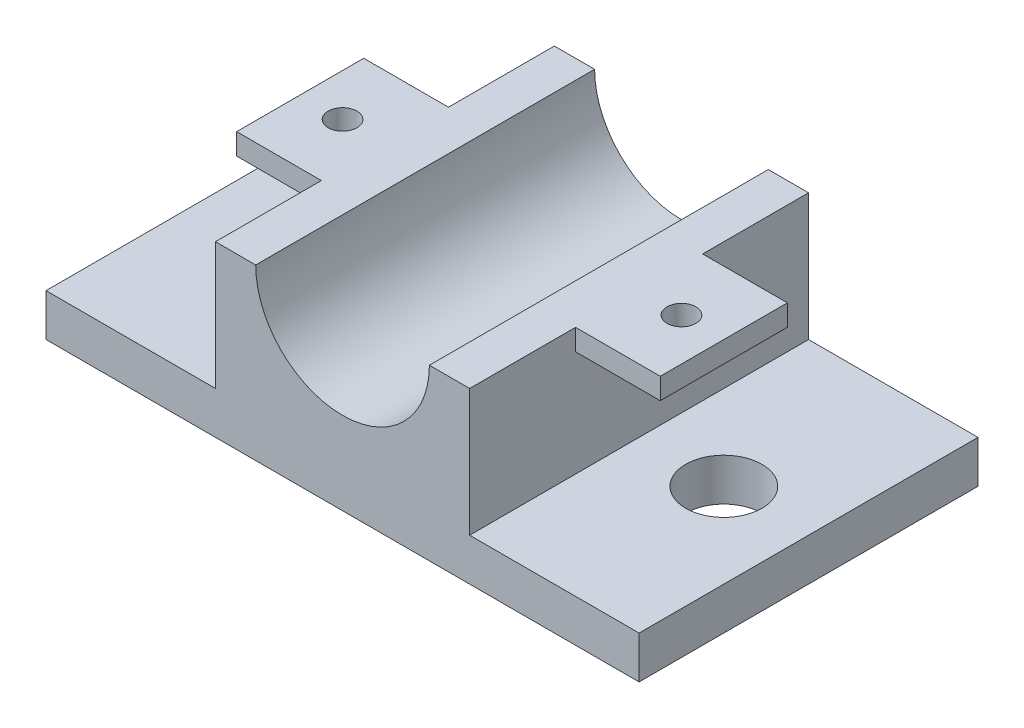
ISO-10303-21;
HEADER;
FILE_DESCRIPTION(('STEP AP214'),'2;1');
FILE_NAME('part.step','',(''),(''),'','','');
FILE_SCHEMA(('AUTOMOTIVE_DESIGN { 1 0 10303 214 1 1 1 1 }'));
ENDSEC;
DATA;
#1=APPLICATION_CONTEXT('core data for automotive mechanical design processes');
#2=APPLICATION_PROTOCOL_DEFINITION('international standard','automotive_design',2000,#1);
#3=PRODUCT_CONTEXT('',#1,'mechanical');
#4=PRODUCT('Part','Part','',(#3));
#5=PRODUCT_RELATED_PRODUCT_CATEGORY('part','',(#4));
#6=PRODUCT_DEFINITION_FORMATION('','',#4);
#7=PRODUCT_DEFINITION_CONTEXT('part definition',#1,'design');
#8=PRODUCT_DEFINITION('design','',#6,#7);
#9=PRODUCT_DEFINITION_SHAPE('','',#8);
#10=(LENGTH_UNIT() NAMED_UNIT(*) SI_UNIT(.MILLI.,.METRE.));
#11=(NAMED_UNIT(*) PLANE_ANGLE_UNIT() SI_UNIT($,.RADIAN.));
#12=(NAMED_UNIT(*) SI_UNIT($,.STERADIAN.) SOLID_ANGLE_UNIT());
#13=UNCERTAINTY_MEASURE_WITH_UNIT(LENGTH_MEASURE(1.E-05),#10,'distance_accuracy_value','');
#14=(GEOMETRIC_REPRESENTATION_CONTEXT(3) GLOBAL_UNCERTAINTY_ASSIGNED_CONTEXT((#13)) GLOBAL_UNIT_ASSIGNED_CONTEXT((#10,
#11,#12)) REPRESENTATION_CONTEXT('',''));
#15=CARTESIAN_POINT('',(0.,0.,0.));
#16=DIRECTION('',(0.,0.,1.));
#17=DIRECTION('',(1.,0.,0.));
#18=AXIS2_PLACEMENT_3D('',#15,#16,#17);
#19=CARTESIAN_POINT('',(0.,20.,0.));
#20=DIRECTION('',(0.,1.,0.));
#21=DIRECTION('',(0.,0.,1.));
#22=AXIS2_PLACEMENT_3D('',#19,#20,#21);
#23=PLANE('',#22);
#24=CARTESIAN_POINT('',(-22.2036474164134,20.,-2.61398176291793));
#25=DIRECTION('',(0.,1.,0.));
#26=DIRECTION('',(0.,0.,1.));
#27=AXIS2_PLACEMENT_3D('',#24,#25,#26);
#28=CIRCLE('',#27,1.7);
#29=CARTESIAN_POINT('',(-22.2036474164134,20.,-0.913981762917934));
#30=VERTEX_POINT('',#29);
#31=EDGE_CURVE('E379',#30,#30,#28,.T.);
#32=ORIENTED_EDGE('',*,*,#31,.F.);
#33=EDGE_LOOP('',(#32));
#34=FACE_BOUND('',#33,.T.);
#35=DIRECTION('',(0.,0.,1.));
#36=VECTOR('',#35,1.);
#37=CARTESIAN_POINT('',(-12.4536474164134,20.,-22.6139817629179));
#38=LINE('',#37,#36);
#39=CARTESIAN_POINT('',(-12.4536474164134,20.,-22.6139817629179));
#40=VERTEX_POINT('',#39);
#41=CARTESIAN_POINT('',(-12.4536474164134,20.,17.3860182370821));
#42=VERTEX_POINT('',#41);
#43=EDGE_CURVE('E11',#40,#42,#38,.T.);
#44=ORIENTED_EDGE('',*,*,#43,.F.);
#45=DIRECTION('',(-1.,0.,0.));
#46=VECTOR('',#45,1.);
#47=CARTESIAN_POINT('',(-17.2036474164134,20.,-22.6139817629179));
#48=LINE('',#47,#46);
#49=CARTESIAN_POINT('',(-17.2036474164134,20.,-22.6139817629179));
#50=VERTEX_POINT('',#49);
#51=EDGE_CURVE('E244',#40,#50,#48,.T.);
#52=ORIENTED_EDGE('',*,*,#51,.T.);
#53=DIRECTION('',(0.,0.,1.));
#54=VECTOR('',#53,1.);
#55=CARTESIAN_POINT('',(-17.2036474164134,20.,-22.6139817629179));
#56=LINE('',#55,#54);
#57=CARTESIAN_POINT('',(-17.2036474164134,20.,-10.1139817629179));
#58=VERTEX_POINT('',#57);
#59=EDGE_CURVE('E233',#50,#58,#56,.T.);
#60=ORIENTED_EDGE('',*,*,#59,.T.);
#61=DIRECTION('',(-1.,0.,0.));
#62=VECTOR('',#61,1.);
#63=CARTESIAN_POINT('',(-17.2036474164134,20.,-10.1139817629179));
#64=LINE('',#63,#62);
#65=CARTESIAN_POINT('',(-27.2036474164134,20.,-10.1139817629179));
#66=VERTEX_POINT('',#65);
#67=EDGE_CURVE('E197',#58,#66,#64,.T.);
#68=ORIENTED_EDGE('',*,*,#67,.T.);
#69=DIRECTION('',(0.,0.,1.));
#70=VECTOR('',#69,1.);
#71=CARTESIAN_POINT('',(-27.2036474164134,20.,4.88601823708207));
#72=LINE('',#71,#70);
#73=CARTESIAN_POINT('',(-27.2036474164134,20.,4.88601823708207));
#74=VERTEX_POINT('',#73);
#75=EDGE_CURVE('E216',#66,#74,#72,.T.);
#76=ORIENTED_EDGE('',*,*,#75,.T.);
#77=DIRECTION('',(1.,0.,0.));
#78=VECTOR('',#77,1.);
#79=CARTESIAN_POINT('',(-17.2036474164134,20.,4.88601823708207));
#80=LINE('',#79,#78);
#81=CARTESIAN_POINT('',(-17.2036474164134,20.,4.88601823708207));
#82=VERTEX_POINT('',#81);
#83=EDGE_CURVE('E56',#74,#82,#80,.T.);
#84=ORIENTED_EDGE('',*,*,#83,.T.);
#85=CARTESIAN_POINT('',(-17.2036474164134,20.,17.3860182370821));
#86=VERTEX_POINT('',#85);
#87=EDGE_CURVE('E237',#82,#86,#56,.T.);
#88=ORIENTED_EDGE('',*,*,#87,.T.);
#89=DIRECTION('',(1.,0.,0.));
#90=VECTOR('',#89,1.);
#91=CARTESIAN_POINT('',(-17.2036474164134,20.,17.3860182370821));
#92=LINE('',#91,#90);
#93=EDGE_CURVE('E238',#86,#42,#92,.T.);
#94=ORIENTED_EDGE('',*,*,#93,.T.);
#95=EDGE_LOOP('',(#44,#52,#60,#68,#76,#84,#88,#94));
#96=FACE_BOUND('',#95,.T.);
#97=ADVANCED_FACE('F33',(#34,#96),#23,.T.);
#98=CARTESIAN_POINT('',(0.,5.,0.));
#99=DIRECTION('',(0.,1.,0.));
#100=DIRECTION('',(0.,0.,1.));
#101=AXIS2_PLACEMENT_3D('',#98,#99,#100);
#102=PLANE('',#101);
#103=CARTESIAN_POINT('',(-27.2036474164134,5.,-2.61398176291793));
#104=DIRECTION('',(0.,1.,0.));
#105=DIRECTION('',(0.,0.,1.));
#106=AXIS2_PLACEMENT_3D('',#103,#104,#105);
#107=CIRCLE('',#106,4.5);
#108=CARTESIAN_POINT('',(-27.2036474164134,5.,1.88601823708207));
#109=VERTEX_POINT('',#108);
#110=EDGE_CURVE('E382',#109,#109,#107,.T.);
#111=ORIENTED_EDGE('',*,*,#110,.F.);
#112=EDGE_LOOP('',(#111));
#113=FACE_BOUND('',#112,.T.);
#114=DIRECTION('',(0.,0.,1.));
#115=VECTOR('',#114,1.);
#116=CARTESIAN_POINT('',(-17.2036474164134,5.,-22.6139817629179));
#117=LINE('',#116,#115);
#118=CARTESIAN_POINT('',(-17.2036474164134,5.,-22.6139817629179));
#119=VERTEX_POINT('',#118);
#120=CARTESIAN_POINT('',(-17.2036474164134,5.,17.3860182370821));
#121=VERTEX_POINT('',#120);
#122=EDGE_CURVE('E231',#119,#121,#117,.T.);
#123=ORIENTED_EDGE('',*,*,#122,.F.);
#124=DIRECTION('',(-1.,0.,0.));
#125=VECTOR('',#124,1.);
#126=CARTESIAN_POINT('',(-37.2036474164134,5.,-22.6139817629179));
#127=LINE('',#126,#125);
#128=CARTESIAN_POINT('',(-37.2036474164134,5.,-22.6139817629179));
#129=VERTEX_POINT('',#128);
#130=EDGE_CURVE('E275',#119,#129,#127,.T.);
#131=ORIENTED_EDGE('',*,*,#130,.T.);
#132=DIRECTION('',(0.,0.,1.));
#133=VECTOR('',#132,1.);
#134=CARTESIAN_POINT('',(-37.2036474164134,5.,-22.6139817629179));
#135=LINE('',#134,#133);
#136=CARTESIAN_POINT('',(-37.2036474164134,5.,17.3860182370821));
#137=VERTEX_POINT('',#136);
#138=EDGE_CURVE('E266',#129,#137,#135,.T.);
#139=ORIENTED_EDGE('',*,*,#138,.T.);
#140=DIRECTION('',(1.,0.,0.));
#141=VECTOR('',#140,1.);
#142=CARTESIAN_POINT('',(-37.2036474164134,5.,17.3860182370821));
#143=LINE('',#142,#141);
#144=EDGE_CURVE('E271',#137,#121,#143,.T.);
#145=ORIENTED_EDGE('',*,*,#144,.T.);
#146=EDGE_LOOP('',(#123,#131,#139,#145));
#147=FACE_BOUND('',#146,.T.);
#148=ADVANCED_FACE('F329',(#113,#147),#102,.T.);
#149=CARTESIAN_POINT('',(-37.2036474164134,5.,-22.6139817629179));
#150=DIRECTION('',(1.,0.,0.));
#151=DIRECTION('',(0.,0.,-1.));
#152=AXIS2_PLACEMENT_3D('',#149,#150,#151);
#153=PLANE('',#152);
#154=DIRECTION('',(0.,0.,1.));
#155=VECTOR('',#154,1.);
#156=CARTESIAN_POINT('',(-37.2036474164134,0.,-22.6139817629179));
#157=LINE('',#156,#155);
#158=CARTESIAN_POINT('',(-37.2036474164134,0.,-22.6139817629179));
#159=VERTEX_POINT('',#158);
#160=CARTESIAN_POINT('',(-37.2036474164134,0.,17.3860182370821));
#161=VERTEX_POINT('',#160);
#162=EDGE_CURVE('E265',#159,#161,#157,.T.);
#163=ORIENTED_EDGE('',*,*,#162,.T.);
#164=DIRECTION('',(0.,-1.,0.));
#165=VECTOR('',#164,1.);
#166=CARTESIAN_POINT('',(-37.2036474164134,5.,17.3860182370821));
#167=LINE('',#166,#165);
#168=EDGE_CURVE('E294',#137,#161,#167,.T.);
#169=ORIENTED_EDGE('',*,*,#168,.F.);
#170=ORIENTED_EDGE('',*,*,#138,.F.);
#171=DIRECTION('',(0.,-1.,0.));
#172=VECTOR('',#171,1.);
#173=CARTESIAN_POINT('',(-37.2036474164134,5.,-22.6139817629179));
#174=LINE('',#173,#172);
#175=EDGE_CURVE('E278',#129,#159,#174,.T.);
#176=ORIENTED_EDGE('',*,*,#175,.T.);
#177=EDGE_LOOP('',(#163,#169,#170,#176));
#178=FACE_BOUND('',#177,.T.);
#179=ADVANCED_FACE('F35',(#178),#153,.F.);
#180=CARTESIAN_POINT('',(-37.2036474164134,5.,17.3860182370821));
#181=DIRECTION('',(0.,0.,-1.));
#182=DIRECTION('',(-1.,0.,0.));
#183=AXIS2_PLACEMENT_3D('',#180,#181,#182);
#184=PLANE('',#183);
#185=CARTESIAN_POINT('',(8.04635258358662,20.,17.3860182370821));
#186=VERTEX_POINT('',#185);
#187=CARTESIAN_POINT('',(12.7963525835866,20.,17.3860182370821));
#188=VERTEX_POINT('',#187);
#189=EDGE_CURVE('E236',#186,#188,#92,.T.);
#190=ORIENTED_EDGE('',*,*,#189,.F.);
#191=CARTESIAN_POINT('',(-2.20364741641339,20.,17.3860182370821));
#192=DIRECTION('',(0.,0.,1.));
#193=DIRECTION('',(1.,0.,0.));
#194=AXIS2_PLACEMENT_3D('',#191,#192,#193);
#195=CIRCLE('',#194,10.25);
#196=EDGE_CURVE('E221',#42,#186,#195,.T.);
#197=ORIENTED_EDGE('',*,*,#196,.F.);
#198=ORIENTED_EDGE('',*,*,#93,.F.);
#199=DIRECTION('',(0.,-1.,0.));
#200=VECTOR('',#199,1.);
#201=CARTESIAN_POINT('',(-17.2036474164134,20.,17.3860182370821));
#202=LINE('',#201,#200);
#203=EDGE_CURVE('E262',#86,#121,#202,.T.);
#204=ORIENTED_EDGE('',*,*,#203,.T.);
#205=ORIENTED_EDGE('',*,*,#144,.F.);
#206=ORIENTED_EDGE('',*,*,#168,.T.);
#207=DIRECTION('',(1.,0.,0.));
#208=VECTOR('',#207,1.);
#209=CARTESIAN_POINT('',(-37.2036474164134,0.,17.3860182370821));
#210=LINE('',#209,#208);
#211=CARTESIAN_POINT('',(32.7963525835866,0.,17.3860182370821));
#212=VERTEX_POINT('',#211);
#213=EDGE_CURVE('E281',#161,#212,#210,.T.);
#214=ORIENTED_EDGE('',*,*,#213,.T.);
#215=DIRECTION('',(0.,-1.,0.));
#216=VECTOR('',#215,1.);
#217=CARTESIAN_POINT('',(32.7963525835866,5.,17.3860182370821));
#218=LINE('',#217,#216);
#219=CARTESIAN_POINT('',(32.7963525835866,5.,17.3860182370821));
#220=VERTEX_POINT('',#219);
#221=EDGE_CURVE('E291',#220,#212,#218,.T.);
#222=ORIENTED_EDGE('',*,*,#221,.F.);
#223=CARTESIAN_POINT('',(12.7963525835866,5.,17.3860182370821));
#224=VERTEX_POINT('',#223);
#225=EDGE_CURVE('E269',#224,#220,#143,.T.);
#226=ORIENTED_EDGE('',*,*,#225,.F.);
#227=DIRECTION('',(0.,-1.,0.));
#228=VECTOR('',#227,1.);
#229=CARTESIAN_POINT('',(12.7963525835866,20.,17.3860182370821));
#230=LINE('',#229,#228);
#231=EDGE_CURVE('E259',#188,#224,#230,.T.);
#232=ORIENTED_EDGE('',*,*,#231,.F.);
#233=EDGE_LOOP('',(#190,#197,#198,#204,#205,#206,#214,#222,#226,#232));
#234=FACE_BOUND('',#233,.T.);
#235=ADVANCED_FACE('F337',(#234),#184,.F.);
#236=CARTESIAN_POINT('',(32.7963525835866,5.,-22.6139817629179));
#237=DIRECTION('',(-1.,0.,0.));
#238=DIRECTION('',(0.,0.,1.));
#239=AXIS2_PLACEMENT_3D('',#236,#237,#238);
#240=PLANE('',#239);
#241=DIRECTION('',(0.,0.,-1.));
#242=VECTOR('',#241,1.);
#243=CARTESIAN_POINT('',(32.7963525835866,0.,-22.6139817629179));
#244=LINE('',#243,#242);
#245=CARTESIAN_POINT('',(32.7963525835866,0.,-22.6139817629179));
#246=VERTEX_POINT('',#245);
#247=EDGE_CURVE('E283',#212,#246,#244,.T.);
#248=ORIENTED_EDGE('',*,*,#247,.T.);
#249=DIRECTION('',(0.,-1.,0.));
#250=VECTOR('',#249,1.);
#251=CARTESIAN_POINT('',(32.7963525835866,5.,-22.6139817629179));
#252=LINE('',#251,#250);
#253=CARTESIAN_POINT('',(32.7963525835866,5.,-22.6139817629179));
#254=VERTEX_POINT('',#253);
#255=EDGE_CURVE('E288',#254,#246,#252,.T.);
#256=ORIENTED_EDGE('',*,*,#255,.F.);
#257=DIRECTION('',(0.,0.,-1.));
#258=VECTOR('',#257,1.);
#259=CARTESIAN_POINT('',(32.7963525835866,5.,-22.6139817629179));
#260=LINE('',#259,#258);
#261=EDGE_CURVE('E273',#220,#254,#260,.T.);
#262=ORIENTED_EDGE('',*,*,#261,.F.);
#263=ORIENTED_EDGE('',*,*,#221,.T.);
#264=EDGE_LOOP('',(#248,#256,#262,#263));
#265=FACE_BOUND('',#264,.T.);
#266=ADVANCED_FACE('F318',(#265),#240,.F.);
#267=CARTESIAN_POINT('',(-37.2036474164134,5.,-22.6139817629179));
#268=DIRECTION('',(0.,0.,1.));
#269=DIRECTION('',(1.,0.,0.));
#270=AXIS2_PLACEMENT_3D('',#267,#268,#269);
#271=PLANE('',#270);
#272=ORIENTED_EDGE('',*,*,#51,.F.);
#273=CARTESIAN_POINT('',(-2.20364741641339,20.,-22.6139817629179));
#274=DIRECTION('',(0.,0.,1.));
#275=DIRECTION('',(1.,0.,0.));
#276=AXIS2_PLACEMENT_3D('',#273,#274,#275);
#277=CIRCLE('',#276,10.25);
#278=CARTESIAN_POINT('',(8.04635258358661,20.,-22.6139817629179));
#279=VERTEX_POINT('',#278);
#280=EDGE_CURVE('E228',#40,#279,#277,.T.);
#281=ORIENTED_EDGE('',*,*,#280,.T.);
#282=CARTESIAN_POINT('',(12.7963525835866,20.,-22.6139817629179));
#283=VERTEX_POINT('',#282);
#284=EDGE_CURVE('E245',#283,#279,#48,.T.);
#285=ORIENTED_EDGE('',*,*,#284,.F.);
#286=DIRECTION('',(0.,-1.,0.));
#287=VECTOR('',#286,1.);
#288=CARTESIAN_POINT('',(12.7963525835866,20.,-22.6139817629179));
#289=LINE('',#288,#287);
#290=CARTESIAN_POINT('',(12.7963525835866,5.,-22.6139817629179));
#291=VERTEX_POINT('',#290);
#292=EDGE_CURVE('E256',#283,#291,#289,.T.);
#293=ORIENTED_EDGE('',*,*,#292,.T.);
#294=EDGE_CURVE('E276',#254,#291,#127,.T.);
#295=ORIENTED_EDGE('',*,*,#294,.F.);
#296=ORIENTED_EDGE('',*,*,#255,.T.);
#297=DIRECTION('',(-1.,0.,0.));
#298=VECTOR('',#297,1.);
#299=CARTESIAN_POINT('',(-37.2036474164134,0.,-22.6139817629179));
#300=LINE('',#299,#298);
#301=EDGE_CURVE('E270',#246,#159,#300,.T.);
#302=ORIENTED_EDGE('',*,*,#301,.T.);
#303=ORIENTED_EDGE('',*,*,#175,.F.);
#304=ORIENTED_EDGE('',*,*,#130,.F.);
#305=DIRECTION('',(0.,-1.,0.));
#306=VECTOR('',#305,1.);
#307=CARTESIAN_POINT('',(-17.2036474164134,20.,-22.6139817629179));
#308=LINE('',#307,#306);
#309=EDGE_CURVE('E248',#50,#119,#308,.T.);
#310=ORIENTED_EDGE('',*,*,#309,.F.);
#311=EDGE_LOOP('',(#272,#281,#285,#293,#295,#296,#302,#303,#304,#310));
#312=FACE_BOUND('',#311,.T.);
#313=ADVANCED_FACE('F305',(#312),#271,.F.);
#314=CARTESIAN_POINT('',(22.7963525835866,5.,-2.61398176291793));
#315=DIRECTION('',(0.,1.,0.));
#316=DIRECTION('',(0.,0.,1.));
#317=AXIS2_PLACEMENT_3D('',#314,#315,#316);
#318=CIRCLE('',#317,4.5);
#319=CARTESIAN_POINT('',(22.7963525835866,5.,1.88601823708207));
#320=VERTEX_POINT('',#319);
#321=EDGE_CURVE('E419',#320,#320,#318,.T.);
#322=ORIENTED_EDGE('',*,*,#321,.F.);
#323=EDGE_LOOP('',(#322));
#324=FACE_BOUND('',#323,.T.);
#325=DIRECTION('',(0.,0.,-1.));
#326=VECTOR('',#325,1.);
#327=CARTESIAN_POINT('',(12.7963525835866,5.,-22.6139817629179));
#328=LINE('',#327,#326);
#329=EDGE_CURVE('E251',#224,#291,#328,.T.);
#330=ORIENTED_EDGE('',*,*,#329,.F.);
#331=ORIENTED_EDGE('',*,*,#225,.T.);
#332=ORIENTED_EDGE('',*,*,#261,.T.);
#333=ORIENTED_EDGE('',*,*,#294,.T.);
#334=EDGE_LOOP('',(#330,#331,#332,#333));
#335=FACE_BOUND('',#334,.T.);
#336=ADVANCED_FACE('F313',(#324,#335),#102,.T.);
#337=CARTESIAN_POINT('',(0.,0.,0.));
#338=DIRECTION('',(0.,1.,0.));
#339=DIRECTION('',(0.,0.,1.));
#340=AXIS2_PLACEMENT_3D('',#337,#338,#339);
#341=PLANE('',#340);
#342=CARTESIAN_POINT('',(22.7963525835866,0.,-2.61398176291793));
#343=DIRECTION('',(0.,1.,0.));
#344=DIRECTION('',(0.,0.,1.));
#345=AXIS2_PLACEMENT_3D('',#342,#343,#344);
#346=CIRCLE('',#345,4.5);
#347=CARTESIAN_POINT('',(22.7963525835866,0.,1.88601823708207));
#348=VERTEX_POINT('',#347);
#349=EDGE_CURVE('E416',#348,#348,#346,.T.);
#350=ORIENTED_EDGE('',*,*,#349,.T.);
#351=EDGE_LOOP('',(#350));
#352=FACE_BOUND('',#351,.T.);
#353=CARTESIAN_POINT('',(-27.2036474164134,0.,-2.61398176291793));
#354=DIRECTION('',(0.,1.,0.));
#355=DIRECTION('',(0.,0.,1.));
#356=AXIS2_PLACEMENT_3D('',#353,#354,#355);
#357=CIRCLE('',#356,4.5);
#358=CARTESIAN_POINT('',(-27.2036474164134,0.,1.88601823708207));
#359=VERTEX_POINT('',#358);
#360=EDGE_CURVE('E376',#359,#359,#357,.T.);
#361=ORIENTED_EDGE('',*,*,#360,.T.);
#362=EDGE_LOOP('',(#361));
#363=FACE_BOUND('',#362,.T.);
#364=ORIENTED_EDGE('',*,*,#162,.F.);
#365=ORIENTED_EDGE('',*,*,#301,.F.);
#366=ORIENTED_EDGE('',*,*,#247,.F.);
#367=ORIENTED_EDGE('',*,*,#213,.F.);
#368=EDGE_LOOP('',(#364,#365,#366,#367));
#369=FACE_BOUND('',#368,.T.);
#370=ADVANCED_FACE('F322',(#352,#363,#369),#341,.F.);
#371=CARTESIAN_POINT('',(-17.2036474164134,20.,-22.6139817629179));
#372=DIRECTION('',(1.,0.,0.));
#373=DIRECTION('',(0.,0.,-1.));
#374=AXIS2_PLACEMENT_3D('',#371,#372,#373);
#375=PLANE('',#374);
#376=ORIENTED_EDGE('',*,*,#87,.F.);
#377=DIRECTION('',(0.,1.,0.));
#378=VECTOR('',#377,1.);
#379=CARTESIAN_POINT('',(-17.2036474164134,17.5,4.88601823708207));
#380=LINE('',#379,#378);
#381=CARTESIAN_POINT('',(-17.2036474164134,17.5,4.88601823708207));
#382=VERTEX_POINT('',#381);
#383=EDGE_CURVE('E219',#382,#82,#380,.T.);
#384=ORIENTED_EDGE('',*,*,#383,.F.);
#385=DIRECTION('',(0.,0.,-1.));
#386=VECTOR('',#385,1.);
#387=CARTESIAN_POINT('',(-17.2036474164134,17.5,4.88601823708207));
#388=LINE('',#387,#386);
#389=CARTESIAN_POINT('',(-17.2036474164134,17.5,-10.1139817629179));
#390=VERTEX_POINT('',#389);
#391=EDGE_CURVE('E201',#382,#390,#388,.T.);
#392=ORIENTED_EDGE('',*,*,#391,.T.);
#393=DIRECTION('',(0.,1.,0.));
#394=VECTOR('',#393,1.);
#395=CARTESIAN_POINT('',(-17.2036474164134,17.5,-10.1139817629179));
#396=LINE('',#395,#394);
#397=EDGE_CURVE('E213',#390,#58,#396,.T.);
#398=ORIENTED_EDGE('',*,*,#397,.T.);
#399=ORIENTED_EDGE('',*,*,#59,.F.);
#400=ORIENTED_EDGE('',*,*,#309,.T.);
#401=ORIENTED_EDGE('',*,*,#122,.T.);
#402=ORIENTED_EDGE('',*,*,#203,.F.);
#403=EDGE_LOOP('',(#376,#384,#392,#398,#399,#400,#401,#402));
#404=FACE_BOUND('',#403,.T.);
#405=ADVANCED_FACE('F333',(#404),#375,.F.);
#406=CARTESIAN_POINT('',(12.7963525835866,20.,-22.6139817629179));
#407=DIRECTION('',(-1.,0.,0.));
#408=DIRECTION('',(0.,0.,1.));
#409=AXIS2_PLACEMENT_3D('',#406,#407,#408);
#410=PLANE('',#409);
#411=DIRECTION('',(0.,0.,-1.));
#412=VECTOR('',#411,1.);
#413=CARTESIAN_POINT('',(12.7963525835866,20.,-22.6139817629179));
#414=LINE('',#413,#412);
#415=CARTESIAN_POINT('',(12.7963525835866,20.,-10.1139817629179));
#416=VERTEX_POINT('',#415);
#417=EDGE_CURVE('E241',#416,#283,#414,.T.);
#418=ORIENTED_EDGE('',*,*,#417,.F.);
#419=DIRECTION('',(0.,1.,0.));
#420=VECTOR('',#419,1.);
#421=CARTESIAN_POINT('',(12.7963525835866,17.5,-10.1139817629179));
#422=LINE('',#421,#420);
#423=CARTESIAN_POINT('',(12.7963525835866,17.5,-10.1139817629179));
#424=VERTEX_POINT('',#423);
#425=EDGE_CURVE('E184',#424,#416,#422,.T.);
#426=ORIENTED_EDGE('',*,*,#425,.F.);
#427=DIRECTION('',(0.,0.,1.));
#428=VECTOR('',#427,1.);
#429=CARTESIAN_POINT('',(12.7963525835866,17.5,4.88601823708206));
#430=LINE('',#429,#428);
#431=CARTESIAN_POINT('',(12.7963525835866,17.5,4.88601823708206));
#432=VERTEX_POINT('',#431);
#433=EDGE_CURVE('E176',#424,#432,#430,.T.);
#434=ORIENTED_EDGE('',*,*,#433,.T.);
#435=DIRECTION('',(0.,1.,0.));
#436=VECTOR('',#435,1.);
#437=CARTESIAN_POINT('',(12.7963525835866,17.5,4.88601823708206));
#438=LINE('',#437,#436);
#439=CARTESIAN_POINT('',(12.7963525835866,20.,4.88601823708206));
#440=VERTEX_POINT('',#439);
#441=EDGE_CURVE('E159',#432,#440,#438,.T.);
#442=ORIENTED_EDGE('',*,*,#441,.T.);
#443=EDGE_CURVE('E242',#188,#440,#414,.T.);
#444=ORIENTED_EDGE('',*,*,#443,.F.);
#445=ORIENTED_EDGE('',*,*,#231,.T.);
#446=ORIENTED_EDGE('',*,*,#329,.T.);
#447=ORIENTED_EDGE('',*,*,#292,.F.);
#448=EDGE_LOOP('',(#418,#426,#434,#442,#444,#445,#446,#447));
#449=FACE_BOUND('',#448,.T.);
#450=ADVANCED_FACE('F183',(#449),#410,.F.);
#451=CARTESIAN_POINT('',(17.7963525835866,20.,-2.61398176291795));
#452=DIRECTION('',(0.,1.,0.));
#453=DIRECTION('',(0.,0.,1.));
#454=AXIS2_PLACEMENT_3D('',#451,#452,#453);
#455=CIRCLE('',#454,1.7);
#456=CARTESIAN_POINT('',(17.7963525835866,20.,-0.913981762917945));
#457=VERTEX_POINT('',#456);
#458=EDGE_CURVE('E373',#457,#457,#455,.T.);
#459=ORIENTED_EDGE('',*,*,#458,.F.);
#460=EDGE_LOOP('',(#459));
#461=FACE_BOUND('',#460,.T.);
#462=DIRECTION('',(0.,0.,1.));
#463=VECTOR('',#462,1.);
#464=CARTESIAN_POINT('',(8.04635258358661,20.,-22.6139817629179));
#465=LINE('',#464,#463);
#466=EDGE_CURVE('E41',#186,#279,#465,.F.);
#467=ORIENTED_EDGE('',*,*,#466,.F.);
#468=ORIENTED_EDGE('',*,*,#189,.T.);
#469=ORIENTED_EDGE('',*,*,#443,.T.);
#470=DIRECTION('',(1.,0.,0.));
#471=VECTOR('',#470,1.);
#472=CARTESIAN_POINT('',(12.7963525835866,20.,4.88601823708206));
#473=LINE('',#472,#471);
#474=CARTESIAN_POINT('',(22.7963525835866,20.,4.88601823708206));
#475=VERTEX_POINT('',#474);
#476=EDGE_CURVE('E164',#440,#475,#473,.T.);
#477=ORIENTED_EDGE('',*,*,#476,.T.);
#478=DIRECTION('',(0.,0.,-1.));
#479=VECTOR('',#478,1.);
#480=CARTESIAN_POINT('',(22.7963525835866,20.,4.88601823708206));
#481=LINE('',#480,#479);
#482=CARTESIAN_POINT('',(22.7963525835866,20.,-10.1139817629179));
#483=VERTEX_POINT('',#482);
#484=EDGE_CURVE('E186',#475,#483,#481,.T.);
#485=ORIENTED_EDGE('',*,*,#484,.T.);
#486=DIRECTION('',(-1.,0.,0.));
#487=VECTOR('',#486,1.);
#488=CARTESIAN_POINT('',(12.7963525835866,20.,-10.1139817629179));
#489=LINE('',#488,#487);
#490=EDGE_CURVE('E48',#483,#416,#489,.T.);
#491=ORIENTED_EDGE('',*,*,#490,.T.);
#492=ORIENTED_EDGE('',*,*,#417,.T.);
#493=ORIENTED_EDGE('',*,*,#284,.T.);
#494=EDGE_LOOP('',(#467,#468,#469,#477,#485,#491,#492,#493));
#495=FACE_BOUND('',#494,.T.);
#496=ADVANCED_FACE('F307',(#461,#495),#23,.T.);
#497=CARTESIAN_POINT('',(-2.20364741641339,20.,-22.6139817629179));
#498=DIRECTION('',(0.,0.,1.));
#499=DIRECTION('',(1.,0.,0.));
#500=AXIS2_PLACEMENT_3D('',#497,#498,#499);
#501=CYLINDRICAL_SURFACE('',#500,10.25);
#502=ORIENTED_EDGE('',*,*,#43,.T.);
#503=ORIENTED_EDGE('',*,*,#196,.T.);
#504=ORIENTED_EDGE('',*,*,#466,.T.);
#505=ORIENTED_EDGE('',*,*,#280,.F.);
#506=EDGE_LOOP('',(#502,#503,#504,#505));
#507=FACE_BOUND('',#506,.T.);
#508=ADVANCED_FACE('F298',(#507),#501,.F.);
#509=CARTESIAN_POINT('',(-17.2036474164134,17.5,4.88601823708207));
#510=DIRECTION('',(0.,0.,1.));
#511=DIRECTION('',(1.,0.,0.));
#512=AXIS2_PLACEMENT_3D('',#509,#510,#511);
#513=PLANE('',#512);
#514=ORIENTED_EDGE('',*,*,#83,.F.);
#515=DIRECTION('',(0.,1.,0.));
#516=VECTOR('',#515,1.);
#517=CARTESIAN_POINT('',(-27.2036474164134,17.5,4.88601823708207));
#518=LINE('',#517,#516);
#519=CARTESIAN_POINT('',(-27.2036474164134,17.5,4.88601823708207));
#520=VERTEX_POINT('',#519);
#521=EDGE_CURVE('E222',#520,#74,#518,.T.);
#522=ORIENTED_EDGE('',*,*,#521,.F.);
#523=DIRECTION('',(1.,0.,0.));
#524=VECTOR('',#523,1.);
#525=CARTESIAN_POINT('',(-17.2036474164134,17.5,4.88601823708207));
#526=LINE('',#525,#524);
#527=EDGE_CURVE('E210',#520,#382,#526,.T.);
#528=ORIENTED_EDGE('',*,*,#527,.T.);
#529=ORIENTED_EDGE('',*,*,#383,.T.);
#530=EDGE_LOOP('',(#514,#522,#528,#529));
#531=FACE_BOUND('',#530,.T.);
#532=ADVANCED_FACE('F370',(#531),#513,.T.);
#533=CARTESIAN_POINT('',(-27.2036474164134,17.5,4.88601823708207));
#534=DIRECTION('',(-1.,0.,0.));
#535=DIRECTION('',(0.,0.,1.));
#536=AXIS2_PLACEMENT_3D('',#533,#534,#535);
#537=PLANE('',#536);
#538=ORIENTED_EDGE('',*,*,#75,.F.);
#539=DIRECTION('',(0.,1.,0.));
#540=VECTOR('',#539,1.);
#541=CARTESIAN_POINT('',(-27.2036474164134,17.5,-10.1139817629179));
#542=LINE('',#541,#540);
#543=CARTESIAN_POINT('',(-27.2036474164134,17.5,-10.1139817629179));
#544=VERTEX_POINT('',#543);
#545=EDGE_CURVE('E224',#544,#66,#542,.T.);
#546=ORIENTED_EDGE('',*,*,#545,.F.);
#547=DIRECTION('',(0.,0.,1.));
#548=VECTOR('',#547,1.);
#549=CARTESIAN_POINT('',(-27.2036474164134,17.5,4.88601823708207));
#550=LINE('',#549,#548);
#551=EDGE_CURVE('E207',#544,#520,#550,.T.);
#552=ORIENTED_EDGE('',*,*,#551,.T.);
#553=ORIENTED_EDGE('',*,*,#521,.T.);
#554=EDGE_LOOP('',(#538,#546,#552,#553));
#555=FACE_BOUND('',#554,.T.);
#556=ADVANCED_FACE('F530',(#555),#537,.T.);
#557=CARTESIAN_POINT('',(-17.2036474164134,17.5,-10.1139817629179));
#558=DIRECTION('',(0.,0.,-1.));
#559=DIRECTION('',(-1.,0.,0.));
#560=AXIS2_PLACEMENT_3D('',#557,#558,#559);
#561=PLANE('',#560);
#562=ORIENTED_EDGE('',*,*,#67,.F.);
#563=ORIENTED_EDGE('',*,*,#397,.F.);
#564=DIRECTION('',(-1.,0.,0.));
#565=VECTOR('',#564,1.);
#566=CARTESIAN_POINT('',(-17.2036474164134,17.5,-10.1139817629179));
#567=LINE('',#566,#565);
#568=EDGE_CURVE('E204',#390,#544,#567,.T.);
#569=ORIENTED_EDGE('',*,*,#568,.T.);
#570=ORIENTED_EDGE('',*,*,#545,.T.);
#571=EDGE_LOOP('',(#562,#563,#569,#570));
#572=FACE_BOUND('',#571,.T.);
#573=ADVANCED_FACE('F522',(#572),#561,.T.);
#574=CARTESIAN_POINT('',(0.,17.5,0.));
#575=DIRECTION('',(0.,1.,0.));
#576=DIRECTION('',(0.,0.,1.));
#577=AXIS2_PLACEMENT_3D('',#574,#575,#576);
#578=PLANE('',#577);
#579=CARTESIAN_POINT('',(-22.2036474164134,17.5,-2.61398176291793));
#580=DIRECTION('',(0.,1.,0.));
#581=DIRECTION('',(0.,0.,1.));
#582=AXIS2_PLACEMENT_3D('',#579,#580,#581);
#583=CIRCLE('',#582,1.7);
#584=CARTESIAN_POINT('',(-22.2036474164134,17.5,-0.913981762917934));
#585=VERTEX_POINT('',#584);
#586=EDGE_CURVE('E189',#585,#585,#583,.T.);
#587=ORIENTED_EDGE('',*,*,#586,.T.);
#588=EDGE_LOOP('',(#587));
#589=FACE_BOUND('',#588,.T.);
#590=ORIENTED_EDGE('',*,*,#391,.F.);
#591=ORIENTED_EDGE('',*,*,#527,.F.);
#592=ORIENTED_EDGE('',*,*,#551,.F.);
#593=ORIENTED_EDGE('',*,*,#568,.F.);
#594=EDGE_LOOP('',(#590,#591,#592,#593));
#595=FACE_BOUND('',#594,.T.);
#596=ADVANCED_FACE('F351',(#589,#595),#578,.F.);
#597=CARTESIAN_POINT('',(12.7963525835866,17.5,-10.1139817629179));
#598=DIRECTION('',(0.,0.,-1.));
#599=DIRECTION('',(-1.,0.,0.));
#600=AXIS2_PLACEMENT_3D('',#597,#598,#599);
#601=PLANE('',#600);
#602=ORIENTED_EDGE('',*,*,#490,.F.);
#603=DIRECTION('',(0.,1.,0.));
#604=VECTOR('',#603,1.);
#605=CARTESIAN_POINT('',(22.7963525835866,17.5,-10.1139817629179));
#606=LINE('',#605,#604);
#607=CARTESIAN_POINT('',(22.7963525835866,17.5,-10.1139817629179));
#608=VERTEX_POINT('',#607);
#609=EDGE_CURVE('E198',#608,#483,#606,.T.);
#610=ORIENTED_EDGE('',*,*,#609,.F.);
#611=DIRECTION('',(-1.,0.,0.));
#612=VECTOR('',#611,1.);
#613=CARTESIAN_POINT('',(12.7963525835866,17.5,-10.1139817629179));
#614=LINE('',#613,#612);
#615=EDGE_CURVE('E170',#608,#424,#614,.T.);
#616=ORIENTED_EDGE('',*,*,#615,.T.);
#617=ORIENTED_EDGE('',*,*,#425,.T.);
#618=EDGE_LOOP('',(#602,#610,#616,#617));
#619=FACE_BOUND('',#618,.T.);
#620=ADVANCED_FACE('F342',(#619),#601,.T.);
#621=CARTESIAN_POINT('',(22.7963525835866,17.5,4.88601823708206));
#622=DIRECTION('',(1.,0.,0.));
#623=DIRECTION('',(0.,0.,-1.));
#624=AXIS2_PLACEMENT_3D('',#621,#622,#623);
#625=PLANE('',#624);
#626=ORIENTED_EDGE('',*,*,#484,.F.);
#627=DIRECTION('',(0.,1.,0.));
#628=VECTOR('',#627,1.);
#629=CARTESIAN_POINT('',(22.7963525835866,17.5,4.88601823708206));
#630=LINE('',#629,#628);
#631=CARTESIAN_POINT('',(22.7963525835866,17.5,4.88601823708206));
#632=VERTEX_POINT('',#631);
#633=EDGE_CURVE('E169',#632,#475,#630,.T.);
#634=ORIENTED_EDGE('',*,*,#633,.F.);
#635=DIRECTION('',(0.,0.,-1.));
#636=VECTOR('',#635,1.);
#637=CARTESIAN_POINT('',(22.7963525835866,17.5,4.88601823708206));
#638=LINE('',#637,#636);
#639=EDGE_CURVE('E179',#632,#608,#638,.T.);
#640=ORIENTED_EDGE('',*,*,#639,.T.);
#641=ORIENTED_EDGE('',*,*,#609,.T.);
#642=EDGE_LOOP('',(#626,#634,#640,#641));
#643=FACE_BOUND('',#642,.T.);
#644=ADVANCED_FACE('F343',(#643),#625,.T.);
#645=CARTESIAN_POINT('',(12.7963525835866,17.5,4.88601823708206));
#646=DIRECTION('',(0.,0.,1.));
#647=DIRECTION('',(1.,0.,0.));
#648=AXIS2_PLACEMENT_3D('',#645,#646,#647);
#649=PLANE('',#648);
#650=ORIENTED_EDGE('',*,*,#476,.F.);
#651=ORIENTED_EDGE('',*,*,#441,.F.);
#652=DIRECTION('',(1.,0.,0.));
#653=VECTOR('',#652,1.);
#654=CARTESIAN_POINT('',(12.7963525835866,17.5,4.88601823708206));
#655=LINE('',#654,#653);
#656=EDGE_CURVE('E162',#432,#632,#655,.T.);
#657=ORIENTED_EDGE('',*,*,#656,.T.);
#658=ORIENTED_EDGE('',*,*,#633,.T.);
#659=EDGE_LOOP('',(#650,#651,#657,#658));
#660=FACE_BOUND('',#659,.T.);
#661=ADVANCED_FACE('F161',(#660),#649,.T.);
#662=CARTESIAN_POINT('',(0.,17.5,0.));
#663=DIRECTION('',(0.,-1.,0.));
#664=DIRECTION('',(0.,0.,-1.));
#665=AXIS2_PLACEMENT_3D('',#662,#663,#664);
#666=PLANE('',#665);
#667=CARTESIAN_POINT('',(17.7963525835866,17.5,-2.61398176291795));
#668=DIRECTION('',(0.,-1.,0.));
#669=DIRECTION('',(0.,0.,-1.));
#670=AXIS2_PLACEMENT_3D('',#667,#668,#669);
#671=CIRCLE('',#670,1.7);
#672=CARTESIAN_POINT('',(17.7963525835866,17.5,-4.31398176291795));
#673=VERTEX_POINT('',#672);
#674=EDGE_CURVE('E375',#673,#673,#671,.T.);
#675=ORIENTED_EDGE('',*,*,#674,.F.);
#676=EDGE_LOOP('',(#675));
#677=FACE_BOUND('',#676,.T.);
#678=ORIENTED_EDGE('',*,*,#433,.F.);
#679=ORIENTED_EDGE('',*,*,#615,.F.);
#680=ORIENTED_EDGE('',*,*,#639,.F.);
#681=ORIENTED_EDGE('',*,*,#656,.F.);
#682=EDGE_LOOP('',(#678,#679,#680,#681));
#683=FACE_BOUND('',#682,.T.);
#684=ADVANCED_FACE('F174',(#677,#683),#666,.T.);
#685=CARTESIAN_POINT('',(-22.2036474164134,20.,-2.61398176291793));
#686=DIRECTION('',(0.,1.,0.));
#687=DIRECTION('',(0.,0.,1.));
#688=AXIS2_PLACEMENT_3D('',#685,#686,#687);
#689=CYLINDRICAL_SURFACE('',#688,1.7);
#690=ORIENTED_EDGE('',*,*,#586,.F.);
#691=EDGE_LOOP('',(#690));
#692=FACE_BOUND('',#691,.T.);
#693=ORIENTED_EDGE('',*,*,#31,.T.);
#694=EDGE_LOOP('',(#693));
#695=FACE_BOUND('',#694,.T.);
#696=ADVANCED_FACE('F392',(#692,#695),#689,.F.);
#697=CARTESIAN_POINT('',(17.7963525835866,20.,-2.61398176291795));
#698=DIRECTION('',(0.,1.,0.));
#699=DIRECTION('',(0.,0.,1.));
#700=AXIS2_PLACEMENT_3D('',#697,#698,#699);
#701=CYLINDRICAL_SURFACE('',#700,1.7);
#702=ORIENTED_EDGE('',*,*,#458,.T.);
#703=EDGE_LOOP('',(#702));
#704=FACE_BOUND('',#703,.T.);
#705=ORIENTED_EDGE('',*,*,#674,.T.);
#706=EDGE_LOOP('',(#705));
#707=FACE_BOUND('',#706,.T.);
#708=ADVANCED_FACE('F394',(#704,#707),#701,.F.);
#709=CARTESIAN_POINT('',(-27.2036474164134,5.,-2.61398176291793));
#710=DIRECTION('',(0.,1.,0.));
#711=DIRECTION('',(0.,0.,1.));
#712=AXIS2_PLACEMENT_3D('',#709,#710,#711);
#713=CYLINDRICAL_SURFACE('',#712,4.5);
#714=ORIENTED_EDGE('',*,*,#360,.F.);
#715=EDGE_LOOP('',(#714));
#716=FACE_BOUND('',#715,.T.);
#717=ORIENTED_EDGE('',*,*,#110,.T.);
#718=EDGE_LOOP('',(#717));
#719=FACE_BOUND('',#718,.T.);
#720=ADVANCED_FACE('F400',(#716,#719),#713,.F.);
#721=CARTESIAN_POINT('',(22.7963525835866,5.,-2.61398176291793));
#722=DIRECTION('',(0.,1.,0.));
#723=DIRECTION('',(0.,0.,1.));
#724=AXIS2_PLACEMENT_3D('',#721,#722,#723);
#725=CYLINDRICAL_SURFACE('',#724,4.5);
#726=ORIENTED_EDGE('',*,*,#349,.F.);
#727=EDGE_LOOP('',(#726));
#728=FACE_BOUND('',#727,.T.);
#729=ORIENTED_EDGE('',*,*,#321,.T.);
#730=EDGE_LOOP('',(#729));
#731=FACE_BOUND('',#730,.T.);
#732=ADVANCED_FACE('F407',(#728,#731),#725,.F.);
#733=CLOSED_SHELL('',(#97,#148,#179,#235,#266,#313,#336,#370,#405,#450,#496,#508,#532,#556,#573,
#596,#620,#644,#661,#684,#696,#708,#720,#732));
#734=MANIFOLD_SOLID_BREP('B2',#733);
#735=ADVANCED_BREP_SHAPE_REPRESENTATION('',(#18,#734),#14);
#736=SHAPE_DEFINITION_REPRESENTATION(#9,#735);
ENDSEC;
END-ISO-10303-21;
